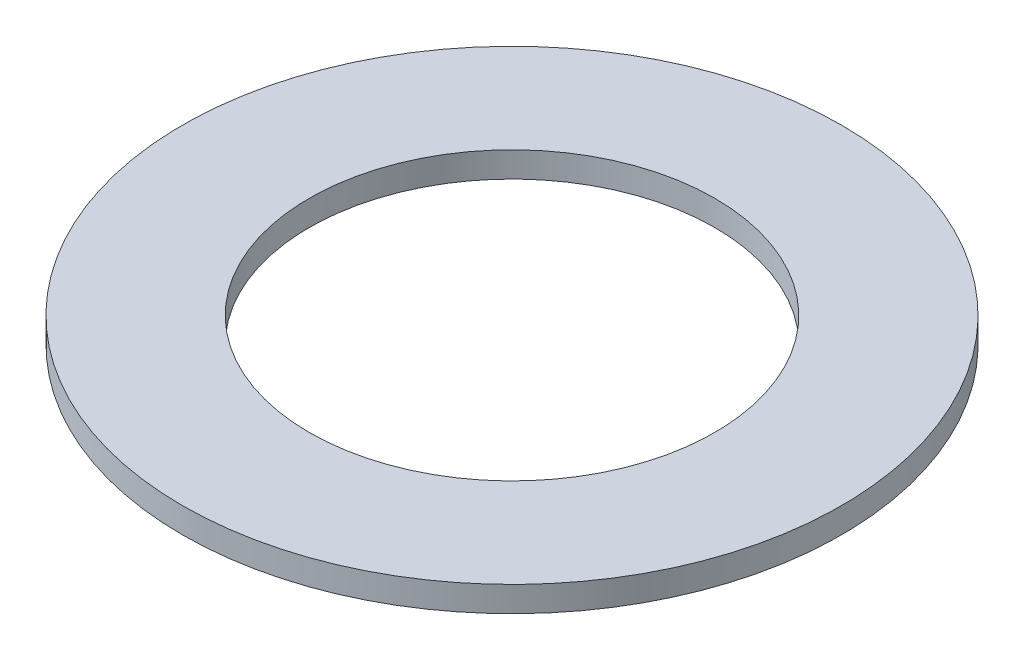
ISO-10303-21;
HEADER;
FILE_DESCRIPTION(('STEP AP214'),'2;1');
FILE_NAME('part.step','',(''),(''),'','','');
FILE_SCHEMA(('AUTOMOTIVE_DESIGN { 1 0 10303 214 1 1 1 1 }'));
ENDSEC;
DATA;
#1=APPLICATION_CONTEXT('core data for automotive mechanical design processes');
#2=APPLICATION_PROTOCOL_DEFINITION('international standard','automotive_design',2000,#1);
#3=PRODUCT_CONTEXT('',#1,'mechanical');
#4=PRODUCT('Part','Part','',(#3));
#5=PRODUCT_RELATED_PRODUCT_CATEGORY('part','',(#4));
#6=PRODUCT_DEFINITION_FORMATION('','',#4);
#7=PRODUCT_DEFINITION_CONTEXT('part definition',#1,'design');
#8=PRODUCT_DEFINITION('design','',#6,#7);
#9=PRODUCT_DEFINITION_SHAPE('','',#8);
#10=(LENGTH_UNIT() NAMED_UNIT(*) SI_UNIT(.MILLI.,.METRE.));
#11=(NAMED_UNIT(*) PLANE_ANGLE_UNIT() SI_UNIT($,.RADIAN.));
#12=(NAMED_UNIT(*) SI_UNIT($,.STERADIAN.) SOLID_ANGLE_UNIT());
#13=UNCERTAINTY_MEASURE_WITH_UNIT(LENGTH_MEASURE(1.E-05),#10,'distance_accuracy_value','');
#14=(GEOMETRIC_REPRESENTATION_CONTEXT(3) GLOBAL_UNCERTAINTY_ASSIGNED_CONTEXT((#13)) GLOBAL_UNIT_ASSIGNED_CONTEXT((#10,
#11,#12)) REPRESENTATION_CONTEXT('',''));
#15=CARTESIAN_POINT('',(0.,0.,0.));
#16=DIRECTION('',(0.,0.,1.));
#17=DIRECTION('',(1.,0.,0.));
#18=AXIS2_PLACEMENT_3D('',#15,#16,#17);
#19=CARTESIAN_POINT('',(0.,0.5,0.));
#20=DIRECTION('',(0.,1.,0.));
#21=DIRECTION('',(0.,0.,1.));
#22=AXIS2_PLACEMENT_3D('',#19,#20,#21);
#23=PLANE('',#22);
#24=CARTESIAN_POINT('',(0.,0.5,0.));
#25=DIRECTION('',(0.,1.,0.));
#26=DIRECTION('',(0.,0.,1.));
#27=AXIS2_PLACEMENT_3D('',#24,#25,#26);
#28=CIRCLE('',#27,6.5);
#29=CARTESIAN_POINT('',(0.,0.5,6.5));
#30=VERTEX_POINT('',#29);
#31=EDGE_CURVE('E10',#30,#30,#28,.T.);
#32=ORIENTED_EDGE('',*,*,#31,.T.);
#33=EDGE_LOOP('',(#32));
#34=FACE_BOUND('',#33,.T.);
#35=CARTESIAN_POINT('',(0.,0.5,0.));
#36=DIRECTION('',(0.,1.,0.));
#37=DIRECTION('',(0.,0.,1.));
#38=AXIS2_PLACEMENT_3D('',#35,#36,#37);
#39=CIRCLE('',#38,4.);
#40=CARTESIAN_POINT('',(0.,0.5,4.));
#41=VERTEX_POINT('',#40);
#42=EDGE_CURVE('E48',#41,#41,#39,.T.);
#43=ORIENTED_EDGE('',*,*,#42,.F.);
#44=EDGE_LOOP('',(#43));
#45=FACE_BOUND('',#44,.T.);
#46=ADVANCED_FACE('F37',(#34,#45),#23,.T.);
#47=CARTESIAN_POINT('',(0.,0.,0.));
#48=DIRECTION('',(0.,1.,0.));
#49=DIRECTION('',(0.,0.,1.));
#50=AXIS2_PLACEMENT_3D('',#47,#48,#49);
#51=PLANE('',#50);
#52=CARTESIAN_POINT('',(0.,0.,0.));
#53=DIRECTION('',(0.,1.,0.));
#54=DIRECTION('',(0.,0.,1.));
#55=AXIS2_PLACEMENT_3D('',#52,#53,#54);
#56=CIRCLE('',#55,6.5);
#57=CARTESIAN_POINT('',(0.,0.,6.5));
#58=VERTEX_POINT('',#57);
#59=EDGE_CURVE('E41',#58,#58,#56,.T.);
#60=ORIENTED_EDGE('',*,*,#59,.F.);
#61=EDGE_LOOP('',(#60));
#62=FACE_BOUND('',#61,.T.);
#63=CARTESIAN_POINT('',(0.,0.,0.));
#64=DIRECTION('',(0.,1.,0.));
#65=DIRECTION('',(0.,0.,1.));
#66=AXIS2_PLACEMENT_3D('',#63,#64,#65);
#67=CIRCLE('',#66,4.);
#68=CARTESIAN_POINT('',(0.,0.,4.));
#69=VERTEX_POINT('',#68);
#70=EDGE_CURVE('E50',#69,#69,#67,.T.);
#71=ORIENTED_EDGE('',*,*,#70,.T.);
#72=EDGE_LOOP('',(#71));
#73=FACE_BOUND('',#72,.T.);
#74=ADVANCED_FACE('F60',(#62,#73),#51,.F.);
#75=CARTESIAN_POINT('',(0.,0.5,0.));
#76=DIRECTION('',(0.,-1.,0.));
#77=DIRECTION('',(0.,0.,-1.));
#78=AXIS2_PLACEMENT_3D('',#75,#76,#77);
#79=CYLINDRICAL_SURFACE('',#78,6.5);
#80=ORIENTED_EDGE('',*,*,#31,.F.);
#81=EDGE_LOOP('',(#80));
#82=FACE_BOUND('',#81,.T.);
#83=ORIENTED_EDGE('',*,*,#59,.T.);
#84=EDGE_LOOP('',(#83));
#85=FACE_BOUND('',#84,.T.);
#86=ADVANCED_FACE('F39',(#82,#85),#79,.T.);
#87=CARTESIAN_POINT('',(0.,0.5,0.));
#88=DIRECTION('',(0.,-1.,0.));
#89=DIRECTION('',(0.,0.,-1.));
#90=AXIS2_PLACEMENT_3D('',#87,#88,#89);
#91=CYLINDRICAL_SURFACE('',#90,4.);
#92=ORIENTED_EDGE('',*,*,#42,.T.);
#93=EDGE_LOOP('',(#92));
#94=FACE_BOUND('',#93,.T.);
#95=ORIENTED_EDGE('',*,*,#70,.F.);
#96=EDGE_LOOP('',(#95));
#97=FACE_BOUND('',#96,.T.);
#98=ADVANCED_FACE('F56',(#94,#97),#91,.F.);
#99=CLOSED_SHELL('',(#46,#74,#86,#98));
#100=MANIFOLD_SOLID_BREP('B2',#99);
#101=ADVANCED_BREP_SHAPE_REPRESENTATION('',(#18,#100),#14);
#102=SHAPE_DEFINITION_REPRESENTATION(#9,#101);
ENDSEC;
END-ISO-10303-21;
